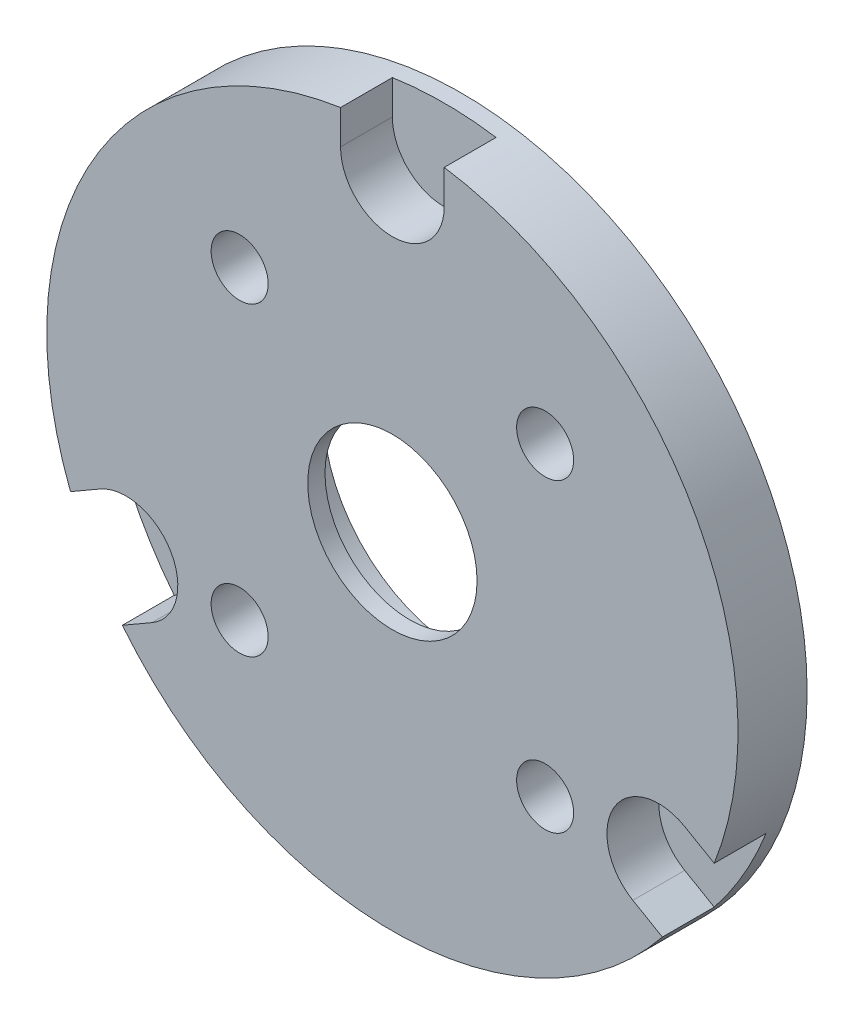
ISO-10303-21;
HEADER;
FILE_DESCRIPTION(('STEP AP214'),'2;1');
FILE_NAME('part.step','',(''),(''),'','','');
FILE_SCHEMA(('AUTOMOTIVE_DESIGN { 1 0 10303 214 1 1 1 1 }'));
ENDSEC;
DATA;
#1=APPLICATION_CONTEXT('core data for automotive mechanical design processes');
#2=APPLICATION_PROTOCOL_DEFINITION('international standard','automotive_design',2000,#1);
#3=PRODUCT_CONTEXT('',#1,'mechanical');
#4=PRODUCT('Part','Part','',(#3));
#5=PRODUCT_RELATED_PRODUCT_CATEGORY('part','',(#4));
#6=PRODUCT_DEFINITION_FORMATION('','',#4);
#7=PRODUCT_DEFINITION_CONTEXT('part definition',#1,'design');
#8=PRODUCT_DEFINITION('design','',#6,#7);
#9=PRODUCT_DEFINITION_SHAPE('','',#8);
#10=(LENGTH_UNIT() NAMED_UNIT(*) SI_UNIT(.MILLI.,.METRE.));
#11=(NAMED_UNIT(*) PLANE_ANGLE_UNIT() SI_UNIT($,.RADIAN.));
#12=(NAMED_UNIT(*) SI_UNIT($,.STERADIAN.) SOLID_ANGLE_UNIT());
#13=UNCERTAINTY_MEASURE_WITH_UNIT(LENGTH_MEASURE(1.E-05),#10,'distance_accuracy_value','');
#14=(GEOMETRIC_REPRESENTATION_CONTEXT(3) GLOBAL_UNCERTAINTY_ASSIGNED_CONTEXT((#13)) GLOBAL_UNIT_ASSIGNED_CONTEXT((#10,
#11,#12)) REPRESENTATION_CONTEXT('',''));
#15=CARTESIAN_POINT('',(0.,0.,0.));
#16=DIRECTION('',(0.,0.,1.));
#17=DIRECTION('',(1.,0.,0.));
#18=AXIS2_PLACEMENT_3D('',#15,#16,#17);
#19=CARTESIAN_POINT('',(0.,0.,0.));
#20=DIRECTION('',(0.,0.,1.));
#21=DIRECTION('',(1.,0.,0.));
#22=AXIS2_PLACEMENT_3D('',#19,#20,#21);
#23=CYLINDRICAL_SURFACE('',#22,4.9);
#24=CARTESIAN_POINT('',(0.,0.,4.));
#25=DIRECTION('',(0.,0.,1.));
#26=DIRECTION('',(1.,0.,0.));
#27=AXIS2_PLACEMENT_3D('',#24,#25,#26);
#28=CIRCLE('',#27,4.9);
#29=CARTESIAN_POINT('',(4.9,0.,4.));
#30=VERTEX_POINT('',#29);
#31=EDGE_CURVE('E411',#30,#30,#28,.T.);
#32=ORIENTED_EDGE('',*,*,#31,.T.);
#33=EDGE_LOOP('',(#32));
#34=FACE_BOUND('',#33,.T.);
#35=CARTESIAN_POINT('',(0.,0.,3.));
#36=DIRECTION('',(0.,0.,-1.));
#37=DIRECTION('',(-1.,0.,0.));
#38=AXIS2_PLACEMENT_3D('',#35,#36,#37);
#39=CIRCLE('',#38,4.9);
#40=CARTESIAN_POINT('',(-4.9,0.,3.));
#41=VERTEX_POINT('',#40);
#42=EDGE_CURVE('E45',#41,#41,#39,.F.);
#43=ORIENTED_EDGE('',*,*,#42,.F.);
#44=EDGE_LOOP('',(#43));
#45=FACE_BOUND('',#44,.T.);
#46=ADVANCED_FACE('F41',(#34,#45),#23,.F.);
#47=CARTESIAN_POINT('',(0.,0.,4.));
#48=DIRECTION('',(0.,0.,-1.));
#49=DIRECTION('',(-1.,0.,0.));
#50=AXIS2_PLACEMENT_3D('',#47,#48,#49);
#51=CYLINDRICAL_SURFACE('',#50,20.);
#52=CARTESIAN_POINT('',(0.,0.,4.));
#53=DIRECTION('',(0.,0.,1.));
#54=DIRECTION('',(1.,0.,0.));
#55=AXIS2_PLACEMENT_3D('',#52,#53,#54);
#56=CIRCLE('',#55,20.);
#57=CARTESIAN_POINT('',(-15.6245437895434,-12.4849361779962,4.));
#58=VERTEX_POINT('',#57);
#59=CARTESIAN_POINT('',(15.624543789544,-12.4849361779956,4.));
#60=VERTEX_POINT('',#59);
#61=EDGE_CURVE('E217',#58,#60,#56,.T.);
#62=ORIENTED_EDGE('',*,*,#61,.F.);
#63=DIRECTION('',(0.,0.,-1.));
#64=VECTOR('',#63,1.);
#65=CARTESIAN_POINT('',(-15.6245437895434,-12.4849361779962,4.));
#66=LINE('',#65,#64);
#67=CARTESIAN_POINT('',(-15.6245437895434,-12.4849361779962,1.));
#68=VERTEX_POINT('',#67);
#69=EDGE_CURVE('E162',#58,#68,#66,.T.);
#70=ORIENTED_EDGE('',*,*,#69,.T.);
#71=CARTESIAN_POINT('',(0.,0.,1.));
#72=DIRECTION('',(0.,0.,1.));
#73=DIRECTION('',(1.,0.,0.));
#74=AXIS2_PLACEMENT_3D('',#71,#72,#73);
#75=CIRCLE('',#74,20.);
#76=CARTESIAN_POINT('',(-18.6245437895436,-7.28878375528967,1.));
#77=VERTEX_POINT('',#76);
#78=EDGE_CURVE('E11',#77,#68,#75,.T.);
#79=ORIENTED_EDGE('',*,*,#78,.F.);
#80=DIRECTION('',(0.,0.,-1.));
#81=VECTOR('',#80,1.);
#82=CARTESIAN_POINT('',(-18.6245437895436,-7.28878375528967,4.));
#83=LINE('',#82,#81);
#84=CARTESIAN_POINT('',(-18.6245437895436,-7.28878375528967,4.));
#85=VERTEX_POINT('',#84);
#86=EDGE_CURVE('E144',#77,#85,#83,.F.);
#87=ORIENTED_EDGE('',*,*,#86,.T.);
#88=CARTESIAN_POINT('',(-3.,19.7737199332852,4.));
#89=VERTEX_POINT('',#88);
#90=EDGE_CURVE('E213',#89,#85,#56,.T.);
#91=ORIENTED_EDGE('',*,*,#90,.F.);
#92=DIRECTION('',(0.,0.,-1.));
#93=VECTOR('',#92,1.);
#94=CARTESIAN_POINT('',(-3.,19.7737199332852,4.));
#95=LINE('',#94,#93);
#96=CARTESIAN_POINT('',(-3.,19.7737199332852,1.));
#97=VERTEX_POINT('',#96);
#98=EDGE_CURVE('E209',#89,#97,#95,.T.);
#99=ORIENTED_EDGE('',*,*,#98,.T.);
#100=CARTESIAN_POINT('',(0.,0.,1.));
#101=DIRECTION('',(0.,0.,1.));
#102=DIRECTION('',(1.,0.,0.));
#103=AXIS2_PLACEMENT_3D('',#100,#101,#102);
#104=CIRCLE('',#103,20.);
#105=CARTESIAN_POINT('',(3.,19.7737199332852,1.));
#106=VERTEX_POINT('',#105);
#107=EDGE_CURVE('E222',#106,#97,#104,.T.);
#108=ORIENTED_EDGE('',*,*,#107,.F.);
#109=DIRECTION('',(0.,0.,-1.));
#110=VECTOR('',#109,1.);
#111=CARTESIAN_POINT('',(3.,19.7737199332852,4.));
#112=LINE('',#111,#110);
#113=CARTESIAN_POINT('',(3.,19.7737199332852,4.));
#114=VERTEX_POINT('',#113);
#115=EDGE_CURVE('E204',#106,#114,#112,.F.);
#116=ORIENTED_EDGE('',*,*,#115,.T.);
#117=CARTESIAN_POINT('',(18.6245437895439,-7.28878375528888,4.));
#118=VERTEX_POINT('',#117);
#119=EDGE_CURVE('E218',#118,#114,#56,.T.);
#120=ORIENTED_EDGE('',*,*,#119,.F.);
#121=DIRECTION('',(0.,0.,-1.));
#122=VECTOR('',#121,1.);
#123=CARTESIAN_POINT('',(18.6245437895439,-7.28878375528888,4.));
#124=LINE('',#123,#122);
#125=CARTESIAN_POINT('',(18.6245437895439,-7.28878375528888,1.));
#126=VERTEX_POINT('',#125);
#127=EDGE_CURVE('E184',#118,#126,#124,.T.);
#128=ORIENTED_EDGE('',*,*,#127,.T.);
#129=CARTESIAN_POINT('',(0.,0.,1.));
#130=DIRECTION('',(0.,0.,1.));
#131=DIRECTION('',(1.,0.,0.));
#132=AXIS2_PLACEMENT_3D('',#129,#130,#131);
#133=CIRCLE('',#132,20.);
#134=CARTESIAN_POINT('',(15.624543789544,-12.4849361779956,1.));
#135=VERTEX_POINT('',#134);
#136=EDGE_CURVE('E226',#135,#126,#133,.T.);
#137=ORIENTED_EDGE('',*,*,#136,.F.);
#138=DIRECTION('',(0.,0.,-1.));
#139=VECTOR('',#138,1.);
#140=CARTESIAN_POINT('',(15.624543789544,-12.4849361779956,4.));
#141=LINE('',#140,#139);
#142=EDGE_CURVE('E180',#135,#60,#141,.F.);
#143=ORIENTED_EDGE('',*,*,#142,.T.);
#144=EDGE_LOOP('',(#62,#70,#79,#87,#91,#99,#108,#116,#120,#128,#137,#143));
#145=FACE_BOUND('',#144,.T.);
#146=CARTESIAN_POINT('',(0.,0.,0.));
#147=DIRECTION('',(0.,0.,1.));
#148=DIRECTION('',(1.,0.,0.));
#149=AXIS2_PLACEMENT_3D('',#146,#147,#148);
#150=CIRCLE('',#149,20.);
#151=CARTESIAN_POINT('',(20.,0.,0.));
#152=VERTEX_POINT('',#151);
#153=EDGE_CURVE('E212',#152,#152,#150,.T.);
#154=ORIENTED_EDGE('',*,*,#153,.T.);
#155=EDGE_LOOP('',(#154));
#156=FACE_BOUND('',#155,.T.);
#157=ADVANCED_FACE('F43',(#145,#156),#51,.T.);
#158=CARTESIAN_POINT('',(0.,0.,4.));
#159=DIRECTION('',(0.,0.,1.));
#160=DIRECTION('',(1.,0.,0.));
#161=AXIS2_PLACEMENT_3D('',#158,#159,#160);
#162=PLANE('',#161);
#163=ORIENTED_EDGE('',*,*,#31,.F.);
#164=EDGE_LOOP('',(#163));
#165=FACE_BOUND('',#164,.T.);
#166=CARTESIAN_POINT('',(-8.83883476483186,8.83883476483183,4.));
#167=DIRECTION('',(0.,0.,1.));
#168=DIRECTION('',(1.,0.,0.));
#169=AXIS2_PLACEMENT_3D('',#166,#167,#168);
#170=CIRCLE('',#169,1.64999999999999);
#171=CARTESIAN_POINT('',(-7.18883476483187,8.83883476483183,4.));
#172=VERTEX_POINT('',#171);
#173=EDGE_CURVE('E413',#172,#172,#170,.T.);
#174=ORIENTED_EDGE('',*,*,#173,.F.);
#175=EDGE_LOOP('',(#174));
#176=FACE_BOUND('',#175,.T.);
#177=CARTESIAN_POINT('',(8.83883476483182,8.8388347648321,4.));
#178=DIRECTION('',(0.,0.,1.));
#179=DIRECTION('',(1.,0.,0.));
#180=AXIS2_PLACEMENT_3D('',#177,#178,#179);
#181=CIRCLE('',#180,1.64999999999999);
#182=CARTESIAN_POINT('',(10.4888347648318,8.8388347648321,4.));
#183=VERTEX_POINT('',#182);
#184=EDGE_CURVE('E419',#183,#183,#181,.T.);
#185=ORIENTED_EDGE('',*,*,#184,.F.);
#186=EDGE_LOOP('',(#185));
#187=FACE_BOUND('',#186,.T.);
#188=CARTESIAN_POINT('',(8.8388347648321,-8.83883476483158,4.));
#189=DIRECTION('',(0.,0.,1.));
#190=DIRECTION('',(1.,0.,0.));
#191=AXIS2_PLACEMENT_3D('',#188,#189,#190);
#192=CIRCLE('',#191,1.64999999999999);
#193=CARTESIAN_POINT('',(10.4888347648321,-8.83883476483158,4.));
#194=VERTEX_POINT('',#193);
#195=EDGE_CURVE('E425',#194,#194,#192,.T.);
#196=ORIENTED_EDGE('',*,*,#195,.F.);
#197=EDGE_LOOP('',(#196));
#198=FACE_BOUND('',#197,.T.);
#199=CARTESIAN_POINT('',(-8.83883476483158,-8.83883476483186,4.));
#200=DIRECTION('',(0.,0.,1.));
#201=DIRECTION('',(1.,0.,0.));
#202=AXIS2_PLACEMENT_3D('',#199,#200,#201);
#203=CIRCLE('',#202,1.64999999999999);
#204=CARTESIAN_POINT('',(-7.18883476483159,-8.83883476483186,4.));
#205=VERTEX_POINT('',#204);
#206=EDGE_CURVE('E430',#205,#205,#203,.T.);
#207=ORIENTED_EDGE('',*,*,#206,.F.);
#208=EDGE_LOOP('',(#207));
#209=FACE_BOUND('',#208,.T.);
#210=DIRECTION('',(0.866025403784439,0.5,0.));
#211=VECTOR('',#210,1.);
#212=CARTESIAN_POINT('',(1.50000000000021,-2.59807621135367,4.));
#213=LINE('',#212,#211);
#214=CARTESIAN_POINT('',(-13.9152521873626,-11.4980762113536,4.));
#215=VERTEX_POINT('',#214);
#216=EDGE_CURVE('E50',#58,#215,#213,.T.);
#217=ORIENTED_EDGE('',*,*,#216,.F.);
#218=ORIENTED_EDGE('',*,*,#61,.T.);
#219=DIRECTION('',(0.866025403784439,-0.5,0.));
#220=VECTOR('',#219,1.);
#221=CARTESIAN_POINT('',(20.1506350946114,-15.0980762113531,4.));
#222=LINE('',#221,#220);
#223=CARTESIAN_POINT('',(13.9152521873634,-11.4980762113531,4.));
#224=VERTEX_POINT('',#223);
#225=EDGE_CURVE('E169',#224,#60,#222,.T.);
#226=ORIENTED_EDGE('',*,*,#225,.F.);
#227=CARTESIAN_POINT('',(15.4152521873634,-8.89999999999976,4.));
#228=DIRECTION('',(0.,0.,1.));
#229=DIRECTION('',(1.,0.,0.));
#230=AXIS2_PLACEMENT_3D('',#227,#228,#229);
#231=CIRCLE('',#230,3.);
#232=CARTESIAN_POINT('',(16.9152521873634,-6.30192378864644,4.));
#233=VERTEX_POINT('',#232);
#234=EDGE_CURVE('E65',#233,#224,#231,.T.);
#235=ORIENTED_EDGE('',*,*,#234,.F.);
#236=DIRECTION('',(-0.866025403784439,0.5,0.));
#237=VECTOR('',#236,1.);
#238=CARTESIAN_POINT('',(1.50000000000021,2.59807621135368,4.));
#239=LINE('',#238,#237);
#240=EDGE_CURVE('E224',#118,#233,#239,.T.);
#241=ORIENTED_EDGE('',*,*,#240,.F.);
#242=ORIENTED_EDGE('',*,*,#119,.T.);
#243=DIRECTION('',(0.,1.,0.));
#244=VECTOR('',#243,1.);
#245=CARTESIAN_POINT('',(3.,25.,4.));
#246=LINE('',#245,#244);
#247=CARTESIAN_POINT('',(3.,17.8,4.));
#248=VERTEX_POINT('',#247);
#249=EDGE_CURVE('E192',#248,#114,#246,.T.);
#250=ORIENTED_EDGE('',*,*,#249,.F.);
#251=CARTESIAN_POINT('',(0.,17.8,4.));
#252=DIRECTION('',(0.,0.,1.));
#253=DIRECTION('',(1.,0.,0.));
#254=AXIS2_PLACEMENT_3D('',#251,#252,#253);
#255=CIRCLE('',#254,3.);
#256=CARTESIAN_POINT('',(-3.,17.8,4.));
#257=VERTEX_POINT('',#256);
#258=EDGE_CURVE('E187',#257,#248,#255,.T.);
#259=ORIENTED_EDGE('',*,*,#258,.F.);
#260=DIRECTION('',(0.,-1.,0.));
#261=VECTOR('',#260,1.);
#262=CARTESIAN_POINT('',(-3.,0.,4.));
#263=LINE('',#262,#261);
#264=EDGE_CURVE('E216',#89,#257,#263,.T.);
#265=ORIENTED_EDGE('',*,*,#264,.F.);
#266=ORIENTED_EDGE('',*,*,#90,.T.);
#267=DIRECTION('',(-0.866025403784439,-0.5,0.));
#268=VECTOR('',#267,1.);
#269=CARTESIAN_POINT('',(-23.1506350946106,-9.90192378864692,4.));
#270=LINE('',#269,#268);
#271=CARTESIAN_POINT('',(-16.9152521873626,-6.30192378864692,4.));
#272=VERTEX_POINT('',#271);
#273=EDGE_CURVE('E151',#272,#85,#270,.T.);
#274=ORIENTED_EDGE('',*,*,#273,.F.);
#275=CARTESIAN_POINT('',(-15.4152521873626,-8.90000000000024,4.));
#276=DIRECTION('',(0.,0.,1.));
#277=DIRECTION('',(1.,0.,0.));
#278=AXIS2_PLACEMENT_3D('',#275,#276,#277);
#279=CIRCLE('',#278,3.);
#280=EDGE_CURVE('E57',#215,#272,#279,.T.);
#281=ORIENTED_EDGE('',*,*,#280,.F.);
#282=EDGE_LOOP('',(#217,#218,#226,#235,#241,#242,#250,#259,#265,#266,#274,#281));
#283=FACE_BOUND('',#282,.T.);
#284=ADVANCED_FACE('F233',(#165,#176,#187,#198,#209,#283),#162,.T.);
#285=CARTESIAN_POINT('',(0.,0.,0.));
#286=DIRECTION('',(0.,0.,1.));
#287=DIRECTION('',(1.,0.,0.));
#288=AXIS2_PLACEMENT_3D('',#285,#286,#287);
#289=PLANE('',#288);
#290=CARTESIAN_POINT('',(0.,0.,0.));
#291=DIRECTION('',(0.,0.,-1.));
#292=DIRECTION('',(-1.,0.,0.));
#293=AXIS2_PLACEMENT_3D('',#290,#291,#292);
#294=CIRCLE('',#293,8.);
#295=CARTESIAN_POINT('',(-8.,0.,0.));
#296=VERTEX_POINT('',#295);
#297=EDGE_CURVE('E406',#296,#296,#294,.T.);
#298=ORIENTED_EDGE('',*,*,#297,.F.);
#299=EDGE_LOOP('',(#298));
#300=FACE_BOUND('',#299,.T.);
#301=CARTESIAN_POINT('',(-8.83883476483186,8.83883476483183,0.));
#302=DIRECTION('',(0.,0.,1.));
#303=DIRECTION('',(1.,0.,0.));
#304=AXIS2_PLACEMENT_3D('',#301,#302,#303);
#305=CIRCLE('',#304,1.65);
#306=CARTESIAN_POINT('',(-7.18883476483186,8.83883476483183,0.));
#307=VERTEX_POINT('',#306);
#308=EDGE_CURVE('E416',#307,#307,#305,.T.);
#309=ORIENTED_EDGE('',*,*,#308,.T.);
#310=EDGE_LOOP('',(#309));
#311=FACE_BOUND('',#310,.T.);
#312=CARTESIAN_POINT('',(8.83883476483182,8.8388347648321,0.));
#313=DIRECTION('',(0.,0.,1.));
#314=DIRECTION('',(1.,0.,0.));
#315=AXIS2_PLACEMENT_3D('',#312,#313,#314);
#316=CIRCLE('',#315,1.65);
#317=CARTESIAN_POINT('',(10.4888347648318,8.8388347648321,0.));
#318=VERTEX_POINT('',#317);
#319=EDGE_CURVE('E422',#318,#318,#316,.T.);
#320=ORIENTED_EDGE('',*,*,#319,.T.);
#321=EDGE_LOOP('',(#320));
#322=FACE_BOUND('',#321,.T.);
#323=CARTESIAN_POINT('',(8.8388347648321,-8.83883476483158,0.));
#324=DIRECTION('',(0.,0.,1.));
#325=DIRECTION('',(1.,0.,0.));
#326=AXIS2_PLACEMENT_3D('',#323,#324,#325);
#327=CIRCLE('',#326,1.65);
#328=CARTESIAN_POINT('',(10.4888347648321,-8.83883476483158,0.));
#329=VERTEX_POINT('',#328);
#330=EDGE_CURVE('E428',#329,#329,#327,.T.);
#331=ORIENTED_EDGE('',*,*,#330,.T.);
#332=EDGE_LOOP('',(#331));
#333=FACE_BOUND('',#332,.T.);
#334=CARTESIAN_POINT('',(-8.83883476483158,-8.83883476483186,0.));
#335=DIRECTION('',(0.,0.,1.));
#336=DIRECTION('',(1.,0.,0.));
#337=AXIS2_PLACEMENT_3D('',#334,#335,#336);
#338=CIRCLE('',#337,1.65);
#339=CARTESIAN_POINT('',(-7.18883476483158,-8.83883476483186,0.));
#340=VERTEX_POINT('',#339);
#341=EDGE_CURVE('E155',#340,#340,#338,.T.);
#342=ORIENTED_EDGE('',*,*,#341,.T.);
#343=EDGE_LOOP('',(#342));
#344=FACE_BOUND('',#343,.T.);
#345=ORIENTED_EDGE('',*,*,#153,.F.);
#346=EDGE_LOOP('',(#345));
#347=FACE_BOUND('',#346,.T.);
#348=ADVANCED_FACE('F320',(#300,#311,#322,#333,#344,#347),#289,.F.);
#349=CARTESIAN_POINT('',(0.,17.8,1.));
#350=DIRECTION('',(0.,0.,1.));
#351=DIRECTION('',(1.,0.,0.));
#352=AXIS2_PLACEMENT_3D('',#349,#350,#351);
#353=PLANE('',#352);
#354=ORIENTED_EDGE('',*,*,#107,.T.);
#355=DIRECTION('',(0.,-1.,0.));
#356=VECTOR('',#355,1.);
#357=CARTESIAN_POINT('',(-3.,17.8,1.));
#358=LINE('',#357,#356);
#359=CARTESIAN_POINT('',(-3.,17.8,1.));
#360=VERTEX_POINT('',#359);
#361=EDGE_CURVE('E195',#97,#360,#358,.T.);
#362=ORIENTED_EDGE('',*,*,#361,.T.);
#363=CARTESIAN_POINT('',(0.,17.8,1.));
#364=DIRECTION('',(0.,0.,1.));
#365=DIRECTION('',(1.,0.,0.));
#366=AXIS2_PLACEMENT_3D('',#363,#364,#365);
#367=CIRCLE('',#366,3.);
#368=CARTESIAN_POINT('',(3.,17.8,1.));
#369=VERTEX_POINT('',#368);
#370=EDGE_CURVE('E188',#360,#369,#367,.T.);
#371=ORIENTED_EDGE('',*,*,#370,.T.);
#372=DIRECTION('',(0.,1.,0.));
#373=VECTOR('',#372,1.);
#374=CARTESIAN_POINT('',(3.,25.,1.));
#375=LINE('',#374,#373);
#376=EDGE_CURVE('E191',#369,#106,#375,.T.);
#377=ORIENTED_EDGE('',*,*,#376,.T.);
#378=EDGE_LOOP('',(#354,#362,#371,#377));
#379=FACE_BOUND('',#378,.T.);
#380=ADVANCED_FACE('F250',(#379),#353,.T.);
#381=CARTESIAN_POINT('',(-3.,17.8,1.));
#382=DIRECTION('',(-1.,0.,0.));
#383=DIRECTION('',(0.,0.,1.));
#384=AXIS2_PLACEMENT_3D('',#381,#382,#383);
#385=PLANE('',#384);
#386=ORIENTED_EDGE('',*,*,#264,.T.);
#387=DIRECTION('',(0.,0.,1.));
#388=VECTOR('',#387,1.);
#389=CARTESIAN_POINT('',(-3.,17.8,1.));
#390=LINE('',#389,#388);
#391=EDGE_CURVE('E201',#360,#257,#390,.T.);
#392=ORIENTED_EDGE('',*,*,#391,.F.);
#393=ORIENTED_EDGE('',*,*,#361,.F.);
#394=ORIENTED_EDGE('',*,*,#98,.F.);
#395=EDGE_LOOP('',(#386,#392,#393,#394));
#396=FACE_BOUND('',#395,.T.);
#397=ADVANCED_FACE('F253',(#396),#385,.F.);
#398=CARTESIAN_POINT('',(3.,25.,1.));
#399=DIRECTION('',(1.,0.,0.));
#400=DIRECTION('',(0.,0.,-1.));
#401=AXIS2_PLACEMENT_3D('',#398,#399,#400);
#402=PLANE('',#401);
#403=ORIENTED_EDGE('',*,*,#376,.F.);
#404=DIRECTION('',(0.,0.,1.));
#405=VECTOR('',#404,1.);
#406=CARTESIAN_POINT('',(3.,17.8,1.));
#407=LINE('',#406,#405);
#408=EDGE_CURVE('E197',#369,#248,#407,.T.);
#409=ORIENTED_EDGE('',*,*,#408,.T.);
#410=ORIENTED_EDGE('',*,*,#249,.T.);
#411=ORIENTED_EDGE('',*,*,#115,.F.);
#412=EDGE_LOOP('',(#403,#409,#410,#411));
#413=FACE_BOUND('',#412,.T.);
#414=ADVANCED_FACE('F246',(#413),#402,.F.);
#415=CARTESIAN_POINT('',(0.,17.8,1.));
#416=DIRECTION('',(0.,0.,1.));
#417=DIRECTION('',(1.,0.,0.));
#418=AXIS2_PLACEMENT_3D('',#415,#416,#417);
#419=CYLINDRICAL_SURFACE('',#418,3.);
#420=ORIENTED_EDGE('',*,*,#258,.T.);
#421=ORIENTED_EDGE('',*,*,#408,.F.);
#422=ORIENTED_EDGE('',*,*,#370,.F.);
#423=ORIENTED_EDGE('',*,*,#391,.T.);
#424=EDGE_LOOP('',(#420,#421,#422,#423));
#425=FACE_BOUND('',#424,.T.);
#426=ADVANCED_FACE('F256',(#425),#419,.F.);
#427=CARTESIAN_POINT('',(15.4152521873634,-8.89999999999976,1.));
#428=DIRECTION('',(0.,0.,1.));
#429=DIRECTION('',(1.,0.,0.));
#430=AXIS2_PLACEMENT_3D('',#427,#428,#429);
#431=PLANE('',#430);
#432=ORIENTED_EDGE('',*,*,#136,.T.);
#433=DIRECTION('',(-0.866025403784439,0.5,0.));
#434=VECTOR('',#433,1.);
#435=CARTESIAN_POINT('',(16.9152521873634,-6.30192378864644,1.));
#436=LINE('',#435,#434);
#437=CARTESIAN_POINT('',(16.9152521873634,-6.30192378864644,1.));
#438=VERTEX_POINT('',#437);
#439=EDGE_CURVE('E172',#126,#438,#436,.T.);
#440=ORIENTED_EDGE('',*,*,#439,.T.);
#441=CARTESIAN_POINT('',(15.4152521873634,-8.89999999999976,1.));
#442=DIRECTION('',(0.,0.,1.));
#443=DIRECTION('',(1.,0.,0.));
#444=AXIS2_PLACEMENT_3D('',#441,#442,#443);
#445=CIRCLE('',#444,3.);
#446=CARTESIAN_POINT('',(13.9152521873634,-11.4980762113531,1.));
#447=VERTEX_POINT('',#446);
#448=EDGE_CURVE('E165',#438,#447,#445,.T.);
#449=ORIENTED_EDGE('',*,*,#448,.T.);
#450=DIRECTION('',(0.866025403784439,-0.5,0.));
#451=VECTOR('',#450,1.);
#452=CARTESIAN_POINT('',(20.1506350946114,-15.0980762113531,1.));
#453=LINE('',#452,#451);
#454=EDGE_CURVE('E168',#447,#135,#453,.T.);
#455=ORIENTED_EDGE('',*,*,#454,.T.);
#456=EDGE_LOOP('',(#432,#440,#449,#455));
#457=FACE_BOUND('',#456,.T.);
#458=ADVANCED_FACE('F258',(#457),#431,.T.);
#459=CARTESIAN_POINT('',(16.9152521873634,-6.30192378864644,1.));
#460=DIRECTION('',(0.5,0.866025403784439,0.));
#461=DIRECTION('',(-0.866025403784439,0.5,0.));
#462=AXIS2_PLACEMENT_3D('',#459,#460,#461);
#463=PLANE('',#462);
#464=ORIENTED_EDGE('',*,*,#240,.T.);
#465=DIRECTION('',(0.,0.,1.));
#466=VECTOR('',#465,1.);
#467=CARTESIAN_POINT('',(16.9152521873634,-6.30192378864644,1.));
#468=LINE('',#467,#466);
#469=EDGE_CURVE('E178',#438,#233,#468,.T.);
#470=ORIENTED_EDGE('',*,*,#469,.F.);
#471=ORIENTED_EDGE('',*,*,#439,.F.);
#472=ORIENTED_EDGE('',*,*,#127,.F.);
#473=EDGE_LOOP('',(#464,#470,#471,#472));
#474=FACE_BOUND('',#473,.T.);
#475=ADVANCED_FACE('F264',(#474),#463,.F.);
#476=CARTESIAN_POINT('',(20.1506350946114,-15.0980762113531,1.));
#477=DIRECTION('',(-0.5,-0.866025403784439,0.));
#478=DIRECTION('',(0.866025403784439,-0.5,0.));
#479=AXIS2_PLACEMENT_3D('',#476,#477,#478);
#480=PLANE('',#479);
#481=ORIENTED_EDGE('',*,*,#454,.F.);
#482=DIRECTION('',(0.,0.,1.));
#483=VECTOR('',#482,1.);
#484=CARTESIAN_POINT('',(13.9152521873634,-11.4980762113531,1.));
#485=LINE('',#484,#483);
#486=EDGE_CURVE('E174',#447,#224,#485,.T.);
#487=ORIENTED_EDGE('',*,*,#486,.T.);
#488=ORIENTED_EDGE('',*,*,#225,.T.);
#489=ORIENTED_EDGE('',*,*,#142,.F.);
#490=EDGE_LOOP('',(#481,#487,#488,#489));
#491=FACE_BOUND('',#490,.T.);
#492=ADVANCED_FACE('F311',(#491),#480,.F.);
#493=CARTESIAN_POINT('',(15.4152521873634,-8.89999999999976,1.));
#494=DIRECTION('',(0.,0.,1.));
#495=DIRECTION('',(1.,0.,0.));
#496=AXIS2_PLACEMENT_3D('',#493,#494,#495);
#497=CYLINDRICAL_SURFACE('',#496,3.);
#498=ORIENTED_EDGE('',*,*,#234,.T.);
#499=ORIENTED_EDGE('',*,*,#486,.F.);
#500=ORIENTED_EDGE('',*,*,#448,.F.);
#501=ORIENTED_EDGE('',*,*,#469,.T.);
#502=EDGE_LOOP('',(#498,#499,#500,#501));
#503=FACE_BOUND('',#502,.T.);
#504=ADVANCED_FACE('F302',(#503),#497,.F.);
#505=CARTESIAN_POINT('',(-15.4152521873626,-8.90000000000024,1.));
#506=DIRECTION('',(0.,0.,1.));
#507=DIRECTION('',(1.,0.,0.));
#508=AXIS2_PLACEMENT_3D('',#505,#506,#507);
#509=PLANE('',#508);
#510=ORIENTED_EDGE('',*,*,#78,.T.);
#511=DIRECTION('',(0.866025403784439,0.5,0.));
#512=VECTOR('',#511,1.);
#513=CARTESIAN_POINT('',(-13.9152521873626,-11.4980762113536,1.));
#514=LINE('',#513,#512);
#515=CARTESIAN_POINT('',(-13.9152521873626,-11.4980762113536,1.));
#516=VERTEX_POINT('',#515);
#517=EDGE_CURVE('E138',#68,#516,#514,.T.);
#518=ORIENTED_EDGE('',*,*,#517,.T.);
#519=CARTESIAN_POINT('',(-15.4152521873626,-8.90000000000024,1.));
#520=DIRECTION('',(0.,0.,1.));
#521=DIRECTION('',(1.,0.,0.));
#522=AXIS2_PLACEMENT_3D('',#519,#520,#521);
#523=CIRCLE('',#522,3.);
#524=CARTESIAN_POINT('',(-16.9152521873626,-6.30192378864692,1.));
#525=VERTEX_POINT('',#524);
#526=EDGE_CURVE('E134',#516,#525,#523,.T.);
#527=ORIENTED_EDGE('',*,*,#526,.T.);
#528=DIRECTION('',(-0.866025403784439,-0.5,0.));
#529=VECTOR('',#528,1.);
#530=CARTESIAN_POINT('',(-23.1506350946106,-9.90192378864692,1.));
#531=LINE('',#530,#529);
#532=EDGE_CURVE('E141',#525,#77,#531,.T.);
#533=ORIENTED_EDGE('',*,*,#532,.T.);
#534=EDGE_LOOP('',(#510,#518,#527,#533));
#535=FACE_BOUND('',#534,.T.);
#536=ADVANCED_FACE('F148',(#535),#509,.T.);
#537=CARTESIAN_POINT('',(-13.9152521873626,-11.4980762113536,1.));
#538=DIRECTION('',(0.5,-0.866025403784438,0.));
#539=DIRECTION('',(0.866025403784439,0.5,0.));
#540=AXIS2_PLACEMENT_3D('',#537,#538,#539);
#541=PLANE('',#540);
#542=ORIENTED_EDGE('',*,*,#216,.T.);
#543=DIRECTION('',(0.,0.,1.));
#544=VECTOR('',#543,1.);
#545=CARTESIAN_POINT('',(-13.9152521873626,-11.4980762113536,1.));
#546=LINE('',#545,#544);
#547=EDGE_CURVE('E137',#516,#215,#546,.T.);
#548=ORIENTED_EDGE('',*,*,#547,.F.);
#549=ORIENTED_EDGE('',*,*,#517,.F.);
#550=ORIENTED_EDGE('',*,*,#69,.F.);
#551=EDGE_LOOP('',(#542,#548,#549,#550));
#552=FACE_BOUND('',#551,.T.);
#553=ADVANCED_FACE('F230',(#552),#541,.F.);
#554=CARTESIAN_POINT('',(-23.1506350946106,-9.90192378864692,1.));
#555=DIRECTION('',(-0.5,0.866025403784439,0.));
#556=DIRECTION('',(-0.866025403784439,-0.5,0.));
#557=AXIS2_PLACEMENT_3D('',#554,#555,#556);
#558=PLANE('',#557);
#559=ORIENTED_EDGE('',*,*,#532,.F.);
#560=DIRECTION('',(0.,0.,1.));
#561=VECTOR('',#560,1.);
#562=CARTESIAN_POINT('',(-16.9152521873626,-6.30192378864692,1.));
#563=LINE('',#562,#561);
#564=EDGE_CURVE('E130',#525,#272,#563,.T.);
#565=ORIENTED_EDGE('',*,*,#564,.T.);
#566=ORIENTED_EDGE('',*,*,#273,.T.);
#567=ORIENTED_EDGE('',*,*,#86,.F.);
#568=EDGE_LOOP('',(#559,#565,#566,#567));
#569=FACE_BOUND('',#568,.T.);
#570=ADVANCED_FACE('F142',(#569),#558,.F.);
#571=CARTESIAN_POINT('',(-15.4152521873626,-8.90000000000024,1.));
#572=DIRECTION('',(0.,0.,1.));
#573=DIRECTION('',(1.,0.,0.));
#574=AXIS2_PLACEMENT_3D('',#571,#572,#573);
#575=CYLINDRICAL_SURFACE('',#574,3.);
#576=ORIENTED_EDGE('',*,*,#280,.T.);
#577=ORIENTED_EDGE('',*,*,#564,.F.);
#578=ORIENTED_EDGE('',*,*,#526,.F.);
#579=ORIENTED_EDGE('',*,*,#547,.T.);
#580=EDGE_LOOP('',(#576,#577,#578,#579));
#581=FACE_BOUND('',#580,.T.);
#582=ADVANCED_FACE('F132',(#581),#575,.F.);
#583=CARTESIAN_POINT('',(-8.83883476483158,-8.83883476483186,4.));
#584=DIRECTION('',(0.,0.,1.));
#585=DIRECTION('',(1.,0.,0.));
#586=AXIS2_PLACEMENT_3D('',#583,#584,#585);
#587=CYLINDRICAL_SURFACE('',#586,1.64999999999999);
#588=ORIENTED_EDGE('',*,*,#341,.F.);
#589=EDGE_LOOP('',(#588));
#590=FACE_BOUND('',#589,.T.);
#591=ORIENTED_EDGE('',*,*,#206,.T.);
#592=EDGE_LOOP('',(#591));
#593=FACE_BOUND('',#592,.T.);
#594=ADVANCED_FACE('F295',(#590,#593),#587,.F.);
#595=CARTESIAN_POINT('',(8.8388347648321,-8.83883476483158,4.));
#596=DIRECTION('',(0.,0.,1.));
#597=DIRECTION('',(1.,0.,0.));
#598=AXIS2_PLACEMENT_3D('',#595,#596,#597);
#599=CYLINDRICAL_SURFACE('',#598,1.64999999999999);
#600=ORIENTED_EDGE('',*,*,#330,.F.);
#601=EDGE_LOOP('',(#600));
#602=FACE_BOUND('',#601,.T.);
#603=ORIENTED_EDGE('',*,*,#195,.T.);
#604=EDGE_LOOP('',(#603));
#605=FACE_BOUND('',#604,.T.);
#606=ADVANCED_FACE('F291',(#602,#605),#599,.F.);
#607=CARTESIAN_POINT('',(8.83883476483182,8.8388347648321,4.));
#608=DIRECTION('',(0.,0.,1.));
#609=DIRECTION('',(1.,0.,0.));
#610=AXIS2_PLACEMENT_3D('',#607,#608,#609);
#611=CYLINDRICAL_SURFACE('',#610,1.64999999999999);
#612=ORIENTED_EDGE('',*,*,#319,.F.);
#613=EDGE_LOOP('',(#612));
#614=FACE_BOUND('',#613,.T.);
#615=ORIENTED_EDGE('',*,*,#184,.T.);
#616=EDGE_LOOP('',(#615));
#617=FACE_BOUND('',#616,.T.);
#618=ADVANCED_FACE('F287',(#614,#617),#611,.F.);
#619=CARTESIAN_POINT('',(-8.83883476483186,8.83883476483183,4.));
#620=DIRECTION('',(0.,0.,1.));
#621=DIRECTION('',(1.,0.,0.));
#622=AXIS2_PLACEMENT_3D('',#619,#620,#621);
#623=CYLINDRICAL_SURFACE('',#622,1.64999999999999);
#624=ORIENTED_EDGE('',*,*,#308,.F.);
#625=EDGE_LOOP('',(#624));
#626=FACE_BOUND('',#625,.T.);
#627=ORIENTED_EDGE('',*,*,#173,.T.);
#628=EDGE_LOOP('',(#627));
#629=FACE_BOUND('',#628,.T.);
#630=ADVANCED_FACE('F283',(#626,#629),#623,.F.);
#631=CARTESIAN_POINT('',(0.,0.,3.));
#632=DIRECTION('',(0.,0.,-1.));
#633=DIRECTION('',(-1.,0.,0.));
#634=AXIS2_PLACEMENT_3D('',#631,#632,#633);
#635=PLANE('',#634);
#636=CARTESIAN_POINT('',(0.,0.,3.));
#637=DIRECTION('',(0.,0.,-1.));
#638=DIRECTION('',(-1.,0.,0.));
#639=AXIS2_PLACEMENT_3D('',#636,#637,#638);
#640=CIRCLE('',#639,8.);
#641=CARTESIAN_POINT('',(-8.,0.,3.));
#642=VERTEX_POINT('',#641);
#643=EDGE_CURVE('E403',#642,#642,#640,.T.);
#644=ORIENTED_EDGE('',*,*,#643,.T.);
#645=EDGE_LOOP('',(#644));
#646=FACE_BOUND('',#645,.T.);
#647=ORIENTED_EDGE('',*,*,#42,.T.);
#648=EDGE_LOOP('',(#647));
#649=FACE_BOUND('',#648,.T.);
#650=ADVANCED_FACE('F286',(#646,#649),#635,.T.);
#651=CARTESIAN_POINT('',(0.,0.,3.));
#652=DIRECTION('',(0.,0.,-1.));
#653=DIRECTION('',(-1.,0.,0.));
#654=AXIS2_PLACEMENT_3D('',#651,#652,#653);
#655=CYLINDRICAL_SURFACE('',#654,8.);
#656=ORIENTED_EDGE('',*,*,#643,.F.);
#657=EDGE_LOOP('',(#656));
#658=FACE_BOUND('',#657,.T.);
#659=ORIENTED_EDGE('',*,*,#297,.T.);
#660=EDGE_LOOP('',(#659));
#661=FACE_BOUND('',#660,.T.);
#662=ADVANCED_FACE('F281',(#658,#661),#655,.F.);
#663=CLOSED_SHELL('',(#46,#157,#284,#348,#380,#397,#414,#426,#458,#475,#492,#504,#536,#553,#570,
#582,#594,#606,#618,#630,#650,#662));
#664=MANIFOLD_SOLID_BREP('B2',#663);
#665=ADVANCED_BREP_SHAPE_REPRESENTATION('',(#18,#664),#14);
#666=SHAPE_DEFINITION_REPRESENTATION(#9,#665);
ENDSEC;
END-ISO-10303-21;
